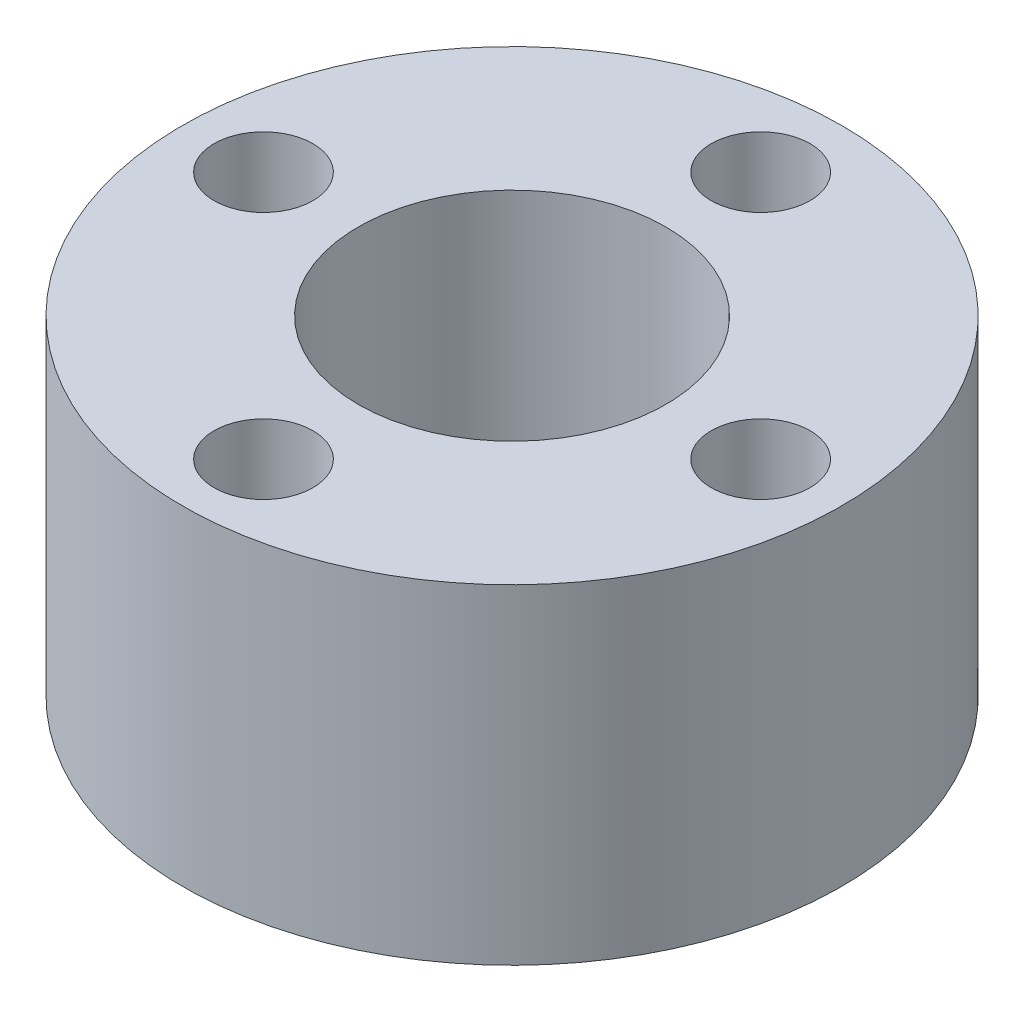
ISO-10303-21;
HEADER;
FILE_DESCRIPTION(('STEP AP214'),'2;1');
FILE_NAME('part.step','',(''),(''),'','','');
FILE_SCHEMA(('AUTOMOTIVE_DESIGN { 1 0 10303 214 1 1 1 1 }'));
ENDSEC;
DATA;
#1=APPLICATION_CONTEXT('core data for automotive mechanical design processes');
#2=APPLICATION_PROTOCOL_DEFINITION('international standard','automotive_design',2000,#1);
#3=PRODUCT_CONTEXT('',#1,'mechanical');
#4=PRODUCT('Part','Part','',(#3));
#5=PRODUCT_RELATED_PRODUCT_CATEGORY('part','',(#4));
#6=PRODUCT_DEFINITION_FORMATION('','',#4);
#7=PRODUCT_DEFINITION_CONTEXT('part definition',#1,'design');
#8=PRODUCT_DEFINITION('design','',#6,#7);
#9=PRODUCT_DEFINITION_SHAPE('','',#8);
#10=(LENGTH_UNIT() NAMED_UNIT(*) SI_UNIT(.MILLI.,.METRE.));
#11=(NAMED_UNIT(*) PLANE_ANGLE_UNIT() SI_UNIT($,.RADIAN.));
#12=(NAMED_UNIT(*) SI_UNIT($,.STERADIAN.) SOLID_ANGLE_UNIT());
#13=UNCERTAINTY_MEASURE_WITH_UNIT(LENGTH_MEASURE(1.E-05),#10,'distance_accuracy_value','');
#14=(GEOMETRIC_REPRESENTATION_CONTEXT(3) GLOBAL_UNCERTAINTY_ASSIGNED_CONTEXT((#13)) GLOBAL_UNIT_ASSIGNED_CONTEXT((#10,
#11,#12)) REPRESENTATION_CONTEXT('',''));
#15=CARTESIAN_POINT('',(0.,0.,0.));
#16=DIRECTION('',(0.,0.,1.));
#17=DIRECTION('',(1.,0.,0.));
#18=AXIS2_PLACEMENT_3D('',#15,#16,#17);
#19=CARTESIAN_POINT('',(0.,35.,0.));
#20=DIRECTION('',(0.,-1.,0.));
#21=DIRECTION('',(0.,0.,-1.));
#22=AXIS2_PLACEMENT_3D('',#19,#20,#21);
#23=CYLINDRICAL_SURFACE('',#22,7.);
#24=CARTESIAN_POINT('',(0.,15.,0.));
#25=DIRECTION('',(0.,-1.,0.));
#26=DIRECTION('',(0.,0.,-1.));
#27=AXIS2_PLACEMENT_3D('',#24,#25,#26);
#28=CIRCLE('',#27,7.);
#29=CARTESIAN_POINT('',(0.,15.,-7.));
#30=VERTEX_POINT('',#29);
#31=EDGE_CURVE('E10',#30,#30,#28,.T.);
#32=ORIENTED_EDGE('',*,*,#31,.F.);
#33=EDGE_LOOP('',(#32));
#34=FACE_BOUND('',#33,.T.);
#35=CARTESIAN_POINT('',(0.,0.,0.));
#36=DIRECTION('',(0.,-1.,0.));
#37=DIRECTION('',(0.,0.,-1.));
#38=AXIS2_PLACEMENT_3D('',#35,#36,#37);
#39=CIRCLE('',#38,7.);
#40=CARTESIAN_POINT('',(0.,0.,-7.));
#41=VERTEX_POINT('',#40);
#42=EDGE_CURVE('E68',#41,#41,#39,.T.);
#43=ORIENTED_EDGE('',*,*,#42,.T.);
#44=EDGE_LOOP('',(#43));
#45=FACE_BOUND('',#44,.T.);
#46=ADVANCED_FACE('F42',(#34,#45),#23,.F.);
#47=CARTESIAN_POINT('',(11.3137,35.,0.));
#48=DIRECTION('',(0.,-1.,0.));
#49=DIRECTION('',(0.,0.,-1.));
#50=AXIS2_PLACEMENT_3D('',#47,#48,#49);
#51=CYLINDRICAL_SURFACE('',#50,2.25);
#52=CARTESIAN_POINT('',(11.3137,15.,0.));
#53=DIRECTION('',(0.,-1.,0.));
#54=DIRECTION('',(0.,0.,-1.));
#55=AXIS2_PLACEMENT_3D('',#52,#53,#54);
#56=CIRCLE('',#55,2.25);
#57=CARTESIAN_POINT('',(11.3137,15.,-2.25));
#58=VERTEX_POINT('',#57);
#59=EDGE_CURVE('E49',#58,#58,#56,.T.);
#60=ORIENTED_EDGE('',*,*,#59,.F.);
#61=EDGE_LOOP('',(#60));
#62=FACE_BOUND('',#61,.T.);
#63=CARTESIAN_POINT('',(11.3137,0.,0.));
#64=DIRECTION('',(0.,-1.,0.));
#65=DIRECTION('',(0.,0.,-1.));
#66=AXIS2_PLACEMENT_3D('',#63,#64,#65);
#67=CIRCLE('',#66,2.25);
#68=CARTESIAN_POINT('',(11.3137,0.,-2.25));
#69=VERTEX_POINT('',#68);
#70=EDGE_CURVE('E71',#69,#69,#67,.T.);
#71=ORIENTED_EDGE('',*,*,#70,.T.);
#72=EDGE_LOOP('',(#71));
#73=FACE_BOUND('',#72,.T.);
#74=ADVANCED_FACE('F106',(#62,#73),#51,.F.);
#75=CARTESIAN_POINT('',(0.,35.,11.3137));
#76=DIRECTION('',(0.,-1.,0.));
#77=DIRECTION('',(0.,0.,-1.));
#78=AXIS2_PLACEMENT_3D('',#75,#76,#77);
#79=CYLINDRICAL_SURFACE('',#78,2.25);
#80=CARTESIAN_POINT('',(0.,15.,11.3137));
#81=DIRECTION('',(0.,-1.,0.));
#82=DIRECTION('',(0.,0.,-1.));
#83=AXIS2_PLACEMENT_3D('',#80,#81,#82);
#84=CIRCLE('',#83,2.25);
#85=CARTESIAN_POINT('',(0.,15.,9.0637));
#86=VERTEX_POINT('',#85);
#87=EDGE_CURVE('E53',#86,#86,#84,.T.);
#88=ORIENTED_EDGE('',*,*,#87,.F.);
#89=EDGE_LOOP('',(#88));
#90=FACE_BOUND('',#89,.T.);
#91=CARTESIAN_POINT('',(0.,0.,11.3137));
#92=DIRECTION('',(0.,-1.,0.));
#93=DIRECTION('',(0.,0.,-1.));
#94=AXIS2_PLACEMENT_3D('',#91,#92,#93);
#95=CIRCLE('',#94,2.25);
#96=CARTESIAN_POINT('',(0.,0.,9.0637));
#97=VERTEX_POINT('',#96);
#98=EDGE_CURVE('E74',#97,#97,#95,.T.);
#99=ORIENTED_EDGE('',*,*,#98,.T.);
#100=EDGE_LOOP('',(#99));
#101=FACE_BOUND('',#100,.T.);
#102=ADVANCED_FACE('F112',(#90,#101),#79,.F.);
#103=CARTESIAN_POINT('',(-11.3137,35.,0.));
#104=DIRECTION('',(0.,-1.,0.));
#105=DIRECTION('',(0.,0.,-1.));
#106=AXIS2_PLACEMENT_3D('',#103,#104,#105);
#107=CYLINDRICAL_SURFACE('',#106,2.25);
#108=CARTESIAN_POINT('',(-11.3137,15.,0.));
#109=DIRECTION('',(0.,-1.,0.));
#110=DIRECTION('',(0.,0.,-1.));
#111=AXIS2_PLACEMENT_3D('',#108,#109,#110);
#112=CIRCLE('',#111,2.25);
#113=CARTESIAN_POINT('',(-11.3137,15.,-2.25));
#114=VERTEX_POINT('',#113);
#115=EDGE_CURVE('E57',#114,#114,#112,.T.);
#116=ORIENTED_EDGE('',*,*,#115,.F.);
#117=EDGE_LOOP('',(#116));
#118=FACE_BOUND('',#117,.T.);
#119=CARTESIAN_POINT('',(-11.3137,0.,0.));
#120=DIRECTION('',(0.,-1.,0.));
#121=DIRECTION('',(0.,0.,-1.));
#122=AXIS2_PLACEMENT_3D('',#119,#120,#121);
#123=CIRCLE('',#122,2.25);
#124=CARTESIAN_POINT('',(-11.3137,0.,-2.25));
#125=VERTEX_POINT('',#124);
#126=EDGE_CURVE('E77',#125,#125,#123,.T.);
#127=ORIENTED_EDGE('',*,*,#126,.T.);
#128=EDGE_LOOP('',(#127));
#129=FACE_BOUND('',#128,.T.);
#130=ADVANCED_FACE('F101',(#118,#129),#107,.F.);
#131=CARTESIAN_POINT('',(0.,35.,-11.3137));
#132=DIRECTION('',(0.,-1.,0.));
#133=DIRECTION('',(0.,0.,-1.));
#134=AXIS2_PLACEMENT_3D('',#131,#132,#133);
#135=CYLINDRICAL_SURFACE('',#134,2.25);
#136=CARTESIAN_POINT('',(0.,15.,-11.3137));
#137=DIRECTION('',(0.,-1.,0.));
#138=DIRECTION('',(0.,0.,-1.));
#139=AXIS2_PLACEMENT_3D('',#136,#137,#138);
#140=CIRCLE('',#139,2.25);
#141=CARTESIAN_POINT('',(0.,15.,-13.5637));
#142=VERTEX_POINT('',#141);
#143=EDGE_CURVE('E62',#142,#142,#140,.T.);
#144=ORIENTED_EDGE('',*,*,#143,.F.);
#145=EDGE_LOOP('',(#144));
#146=FACE_BOUND('',#145,.T.);
#147=CARTESIAN_POINT('',(0.,0.,-11.3137));
#148=DIRECTION('',(0.,-1.,0.));
#149=DIRECTION('',(0.,0.,-1.));
#150=AXIS2_PLACEMENT_3D('',#147,#148,#149);
#151=CIRCLE('',#150,2.25);
#152=CARTESIAN_POINT('',(0.,0.,-13.5637));
#153=VERTEX_POINT('',#152);
#154=EDGE_CURVE('E80',#153,#153,#151,.T.);
#155=ORIENTED_EDGE('',*,*,#154,.T.);
#156=EDGE_LOOP('',(#155));
#157=FACE_BOUND('',#156,.T.);
#158=ADVANCED_FACE('F44',(#146,#157),#135,.F.);
#159=CARTESIAN_POINT('',(0.,-212.,0.));
#160=DIRECTION('',(0.,1.,0.));
#161=DIRECTION('',(0.,0.,1.));
#162=AXIS2_PLACEMENT_3D('',#159,#160,#161);
#163=CYLINDRICAL_SURFACE('',#162,15.);
#164=CARTESIAN_POINT('',(0.,15.,0.));
#165=DIRECTION('',(0.,-1.,0.));
#166=DIRECTION('',(0.,0.,-1.));
#167=AXIS2_PLACEMENT_3D('',#164,#165,#166);
#168=CIRCLE('',#167,15.);
#169=CARTESIAN_POINT('',(0.,15.,-15.));
#170=VERTEX_POINT('',#169);
#171=EDGE_CURVE('E65',#170,#170,#168,.F.);
#172=ORIENTED_EDGE('',*,*,#171,.F.);
#173=EDGE_LOOP('',(#172));
#174=FACE_BOUND('',#173,.T.);
#175=CARTESIAN_POINT('',(0.,0.,0.));
#176=DIRECTION('',(0.,-1.,0.));
#177=DIRECTION('',(0.,0.,-1.));
#178=AXIS2_PLACEMENT_3D('',#175,#176,#177);
#179=CIRCLE('',#178,15.);
#180=CARTESIAN_POINT('',(0.,0.,-15.));
#181=VERTEX_POINT('',#180);
#182=EDGE_CURVE('E83',#181,#181,#179,.T.);
#183=ORIENTED_EDGE('',*,*,#182,.F.);
#184=EDGE_LOOP('',(#183));
#185=FACE_BOUND('',#184,.T.);
#186=ADVANCED_FACE('F89',(#174,#185),#163,.T.);
#187=CARTESIAN_POINT('',(0.,15.,0.));
#188=DIRECTION('',(0.,-1.,0.));
#189=DIRECTION('',(0.,0.,-1.));
#190=AXIS2_PLACEMENT_3D('',#187,#188,#189);
#191=PLANE('',#190);
#192=ORIENTED_EDGE('',*,*,#143,.T.);
#193=EDGE_LOOP('',(#192));
#194=FACE_BOUND('',#193,.T.);
#195=ORIENTED_EDGE('',*,*,#115,.T.);
#196=EDGE_LOOP('',(#195));
#197=FACE_BOUND('',#196,.T.);
#198=ORIENTED_EDGE('',*,*,#87,.T.);
#199=EDGE_LOOP('',(#198));
#200=FACE_BOUND('',#199,.T.);
#201=ORIENTED_EDGE('',*,*,#59,.T.);
#202=EDGE_LOOP('',(#201));
#203=FACE_BOUND('',#202,.T.);
#204=ORIENTED_EDGE('',*,*,#31,.T.);
#205=EDGE_LOOP('',(#204));
#206=FACE_BOUND('',#205,.T.);
#207=ORIENTED_EDGE('',*,*,#171,.T.);
#208=EDGE_LOOP('',(#207));
#209=FACE_BOUND('',#208,.T.);
#210=ADVANCED_FACE('F91',(#194,#197,#200,#203,#206,#209),#191,.F.);
#211=CARTESIAN_POINT('',(0.,0.,0.));
#212=DIRECTION('',(0.,-1.,0.));
#213=DIRECTION('',(0.,0.,-1.));
#214=AXIS2_PLACEMENT_3D('',#211,#212,#213);
#215=PLANE('',#214);
#216=ORIENTED_EDGE('',*,*,#42,.F.);
#217=EDGE_LOOP('',(#216));
#218=FACE_BOUND('',#217,.T.);
#219=ORIENTED_EDGE('',*,*,#70,.F.);
#220=EDGE_LOOP('',(#219));
#221=FACE_BOUND('',#220,.T.);
#222=ORIENTED_EDGE('',*,*,#98,.F.);
#223=EDGE_LOOP('',(#222));
#224=FACE_BOUND('',#223,.T.);
#225=ORIENTED_EDGE('',*,*,#126,.F.);
#226=EDGE_LOOP('',(#225));
#227=FACE_BOUND('',#226,.T.);
#228=ORIENTED_EDGE('',*,*,#154,.F.);
#229=EDGE_LOOP('',(#228));
#230=FACE_BOUND('',#229,.T.);
#231=ORIENTED_EDGE('',*,*,#182,.T.);
#232=EDGE_LOOP('',(#231));
#233=FACE_BOUND('',#232,.T.);
#234=ADVANCED_FACE('F87',(#218,#221,#224,#227,#230,#233),#215,.T.);
#235=CLOSED_SHELL('',(#46,#74,#102,#130,#158,#186,#210,#234));
#236=MANIFOLD_SOLID_BREP('B2',#235);
#237=ADVANCED_BREP_SHAPE_REPRESENTATION('',(#18,#236),#14);
#238=SHAPE_DEFINITION_REPRESENTATION(#9,#237);
ENDSEC;
END-ISO-10303-21;
